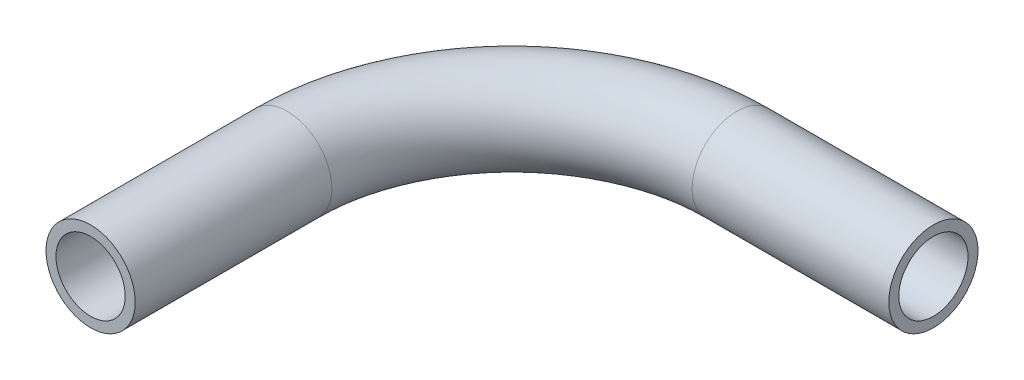
ISO-10303-21;
HEADER;
FILE_DESCRIPTION(('STEP AP214'),'2;1');
FILE_NAME('part.step','',(''),(''),'','','');
FILE_SCHEMA(('AUTOMOTIVE_DESIGN { 1 0 10303 214 1 1 1 1 }'));
ENDSEC;
DATA;
#1=APPLICATION_CONTEXT('core data for automotive mechanical design processes');
#2=APPLICATION_PROTOCOL_DEFINITION('international standard','automotive_design',2000,#1);
#3=PRODUCT_CONTEXT('',#1,'mechanical');
#4=PRODUCT('Part','Part','',(#3));
#5=PRODUCT_RELATED_PRODUCT_CATEGORY('part','',(#4));
#6=PRODUCT_DEFINITION_FORMATION('','',#4);
#7=PRODUCT_DEFINITION_CONTEXT('part definition',#1,'design');
#8=PRODUCT_DEFINITION('design','',#6,#7);
#9=PRODUCT_DEFINITION_SHAPE('','',#8);
#10=(LENGTH_UNIT() NAMED_UNIT(*) SI_UNIT(.MILLI.,.METRE.));
#11=(NAMED_UNIT(*) PLANE_ANGLE_UNIT() SI_UNIT($,.RADIAN.));
#12=(NAMED_UNIT(*) SI_UNIT($,.STERADIAN.) SOLID_ANGLE_UNIT());
#13=UNCERTAINTY_MEASURE_WITH_UNIT(LENGTH_MEASURE(1.E-05),#10,'distance_accuracy_value','');
#14=(GEOMETRIC_REPRESENTATION_CONTEXT(3) GLOBAL_UNCERTAINTY_ASSIGNED_CONTEXT((#13)) GLOBAL_UNIT_ASSIGNED_CONTEXT((#10,
#11,#12)) REPRESENTATION_CONTEXT('',''));
#15=CARTESIAN_POINT('',(0.,0.,0.));
#16=DIRECTION('',(0.,0.,1.));
#17=DIRECTION('',(1.,0.,0.));
#18=AXIS2_PLACEMENT_3D('',#15,#16,#17);
#19=CARTESIAN_POINT('',(0.,0.,0.));
#20=DIRECTION('',(0.,0.,1.));
#21=DIRECTION('',(1.,0.,0.));
#22=AXIS2_PLACEMENT_3D('',#19,#20,#21);
#23=PLANE('',#22);
#24=CARTESIAN_POINT('',(0.,0.,0.));
#25=DIRECTION('',(0.,0.,1.));
#26=DIRECTION('',(1.,0.,0.));
#27=AXIS2_PLACEMENT_3D('',#24,#25,#26);
#28=CIRCLE('',#27,2.4638);
#29=CARTESIAN_POINT('',(2.4638,0.,0.));
#30=VERTEX_POINT('',#29);
#31=EDGE_CURVE('E54',#30,#30,#28,.T.);
#32=ORIENTED_EDGE('',*,*,#31,.F.);
#33=EDGE_LOOP('',(#32));
#34=FACE_BOUND('',#33,.T.);
#35=CARTESIAN_POINT('',(0.,0.,0.));
#36=DIRECTION('',(0.,0.,1.));
#37=DIRECTION('',(1.,0.,0.));
#38=AXIS2_PLACEMENT_3D('',#35,#36,#37);
#39=CIRCLE('',#38,3.175);
#40=CARTESIAN_POINT('',(3.175,0.,0.));
#41=VERTEX_POINT('',#40);
#42=EDGE_CURVE('E45',#41,#41,#39,.T.);
#43=ORIENTED_EDGE('',*,*,#42,.T.);
#44=EDGE_LOOP('',(#43));
#45=FACE_BOUND('',#44,.T.);
#46=ADVANCED_FACE('F31',(#34,#45),#23,.T.);
#47=CARTESIAN_POINT('',(30.,0.,-30.));
#48=DIRECTION('',(-1.,0.,0.));
#49=DIRECTION('',(0.,0.,1.));
#50=AXIS2_PLACEMENT_3D('',#47,#48,#49);
#51=PLANE('',#50);
#52=CARTESIAN_POINT('',(30.,0.,-30.));
#53=DIRECTION('',(-1.,0.,0.));
#54=DIRECTION('',(0.,0.,1.));
#55=AXIS2_PLACEMENT_3D('',#52,#53,#54);
#56=CIRCLE('',#55,2.4638);
#57=CARTESIAN_POINT('',(30.,0.,-27.5362));
#58=VERTEX_POINT('',#57);
#59=EDGE_CURVE('E50',#58,#58,#56,.T.);
#60=ORIENTED_EDGE('',*,*,#59,.T.);
#61=EDGE_LOOP('',(#60));
#62=FACE_BOUND('',#61,.T.);
#63=CARTESIAN_POINT('',(30.,0.,-30.));
#64=DIRECTION('',(-1.,0.,0.));
#65=DIRECTION('',(0.,0.,1.));
#66=AXIS2_PLACEMENT_3D('',#63,#64,#65);
#67=CIRCLE('',#66,3.175);
#68=CARTESIAN_POINT('',(30.,0.,-26.825));
#69=VERTEX_POINT('',#68);
#70=EDGE_CURVE('E10',#69,#69,#67,.T.);
#71=ORIENTED_EDGE('',*,*,#70,.F.);
#72=EDGE_LOOP('',(#71));
#73=FACE_BOUND('',#72,.T.);
#74=ADVANCED_FACE('F74',(#62,#73),#51,.F.);
#75=CARTESIAN_POINT('',(0.,0.,0.));
#76=DIRECTION('',(0.,0.,-1.));
#77=DIRECTION('',(-1.,0.,0.));
#78=AXIS2_PLACEMENT_3D('',#75,#76,#77);
#79=CYLINDRICAL_SURFACE('',#78,3.175);
#80=CARTESIAN_POINT('',(0.,0.,-14.));
#81=DIRECTION('',(0.,0.,1.));
#82=DIRECTION('',(1.,0.,0.));
#83=AXIS2_PLACEMENT_3D('',#80,#81,#82);
#84=CIRCLE('',#83,3.175);
#85=CARTESIAN_POINT('',(-3.175,0.,-14.));
#86=VERTEX_POINT('',#85);
#87=EDGE_CURVE('E41',#86,#86,#84,.T.);
#88=ORIENTED_EDGE('',*,*,#87,.T.);
#89=EDGE_LOOP('',(#88));
#90=FACE_BOUND('',#89,.T.);
#91=ORIENTED_EDGE('',*,*,#42,.F.);
#92=EDGE_LOOP('',(#91));
#93=FACE_BOUND('',#92,.T.);
#94=ADVANCED_FACE('F78',(#90,#93),#79,.T.);
#95=CARTESIAN_POINT('',(16.,0.,-14.));
#96=DIRECTION('',(0.,-1.,0.));
#97=DIRECTION('',(0.,0.,-1.));
#98=AXIS2_PLACEMENT_3D('',#95,#96,#97);
#99=TOROIDAL_SURFACE('',#98,16.,3.175);
#100=CARTESIAN_POINT('',(16.,0.,-30.));
#101=DIRECTION('',(-1.,0.,0.));
#102=DIRECTION('',(0.,0.,1.));
#103=AXIS2_PLACEMENT_3D('',#100,#101,#102);
#104=CIRCLE('',#103,3.175);
#105=CARTESIAN_POINT('',(16.,0.,-33.175));
#106=VERTEX_POINT('',#105);
#107=EDGE_CURVE('E37',#106,#106,#104,.T.);
#108=CARTESIAN_POINT('',(16.,0.,-14.));
#109=DIRECTION('',(0.,-1.,0.));
#110=DIRECTION('',(0.,0.,-1.));
#111=AXIS2_PLACEMENT_3D('',#108,#109,#110);
#112=CIRCLE('',#111,19.175);
#113=EDGE_CURVE('',#86,#106,#112,.T.);
#114=ORIENTED_EDGE('',*,*,#87,.F.);
#115=ORIENTED_EDGE('',*,*,#107,.T.);
#116=ORIENTED_EDGE('',*,*,#113,.T.);
#117=ORIENTED_EDGE('',*,*,#113,.F.);
#118=EDGE_LOOP('',(#114,#116,#115,#117));
#119=FACE_BOUND('',#118,.T.);
#120=ADVANCED_FACE('F80',(#119),#99,.T.);
#121=CARTESIAN_POINT('',(16.,0.,-30.));
#122=DIRECTION('',(1.,0.,0.));
#123=DIRECTION('',(0.,0.,-1.));
#124=AXIS2_PLACEMENT_3D('',#121,#122,#123);
#125=CYLINDRICAL_SURFACE('',#124,3.175);
#126=ORIENTED_EDGE('',*,*,#107,.F.);
#127=EDGE_LOOP('',(#126));
#128=FACE_BOUND('',#127,.T.);
#129=ORIENTED_EDGE('',*,*,#70,.T.);
#130=EDGE_LOOP('',(#129));
#131=FACE_BOUND('',#130,.T.);
#132=ADVANCED_FACE('F68',(#128,#131),#125,.T.);
#133=CARTESIAN_POINT('',(0.,0.,0.));
#134=DIRECTION('',(0.,0.,-1.));
#135=DIRECTION('',(-1.,0.,0.));
#136=AXIS2_PLACEMENT_3D('',#133,#134,#135);
#137=CYLINDRICAL_SURFACE('',#136,2.4638);
#138=CARTESIAN_POINT('',(0.,0.,-14.));
#139=DIRECTION('',(0.,0.,-1.));
#140=DIRECTION('',(-1.,0.,0.));
#141=AXIS2_PLACEMENT_3D('',#138,#139,#140);
#142=CIRCLE('',#141,2.4638);
#143=CARTESIAN_POINT('',(-2.4638,0.,-14.));
#144=VERTEX_POINT('',#143);
#145=EDGE_CURVE('E57',#144,#144,#142,.F.);
#146=ORIENTED_EDGE('',*,*,#145,.F.);
#147=EDGE_LOOP('',(#146));
#148=FACE_BOUND('',#147,.T.);
#149=ORIENTED_EDGE('',*,*,#31,.T.);
#150=EDGE_LOOP('',(#149));
#151=FACE_BOUND('',#150,.T.);
#152=ADVANCED_FACE('F65',(#148,#151),#137,.F.);
#153=CARTESIAN_POINT('',(16.,0.,-14.));
#154=DIRECTION('',(0.,-1.,0.));
#155=DIRECTION('',(0.,0.,-1.));
#156=AXIS2_PLACEMENT_3D('',#153,#154,#155);
#157=TOROIDAL_SURFACE('',#156,16.,2.4638);
#158=CARTESIAN_POINT('',(16.,0.,-30.));
#159=DIRECTION('',(-1.,0.,0.));
#160=DIRECTION('',(0.,0.,1.));
#161=AXIS2_PLACEMENT_3D('',#158,#159,#160);
#162=CIRCLE('',#161,2.4638);
#163=CARTESIAN_POINT('',(16.,0.,-32.4638));
#164=VERTEX_POINT('',#163);
#165=EDGE_CURVE('E53',#164,#164,#162,.T.);
#166=CARTESIAN_POINT('',(16.,0.,-14.));
#167=DIRECTION('',(0.,-1.,0.));
#168=DIRECTION('',(0.,0.,-1.));
#169=AXIS2_PLACEMENT_3D('',#166,#167,#168);
#170=CIRCLE('',#169,18.4638);
#171=EDGE_CURVE('',#144,#164,#170,.T.);
#172=ORIENTED_EDGE('',*,*,#145,.T.);
#173=ORIENTED_EDGE('',*,*,#165,.F.);
#174=ORIENTED_EDGE('',*,*,#171,.T.);
#175=ORIENTED_EDGE('',*,*,#171,.F.);
#176=EDGE_LOOP('',(#172,#174,#173,#175));
#177=FACE_BOUND('',#176,.T.);
#178=ADVANCED_FACE('F63',(#177),#157,.F.);
#179=CARTESIAN_POINT('',(16.,0.,-30.));
#180=DIRECTION('',(1.,0.,0.));
#181=DIRECTION('',(0.,0.,-1.));
#182=AXIS2_PLACEMENT_3D('',#179,#180,#181);
#183=CYLINDRICAL_SURFACE('',#182,2.4638);
#184=ORIENTED_EDGE('',*,*,#165,.T.);
#185=EDGE_LOOP('',(#184));
#186=FACE_BOUND('',#185,.T.);
#187=ORIENTED_EDGE('',*,*,#59,.F.);
#188=EDGE_LOOP('',(#187));
#189=FACE_BOUND('',#188,.T.);
#190=ADVANCED_FACE('F75',(#186,#189),#183,.F.);
#191=CLOSED_SHELL('',(#46,#74,#94,#120,#132,#152,#178,#190));
#192=MANIFOLD_SOLID_BREP('B2',#191);
#193=ADVANCED_BREP_SHAPE_REPRESENTATION('',(#18,#192),#14);
#194=SHAPE_DEFINITION_REPRESENTATION(#9,#193);
ENDSEC;
END-ISO-10303-21;
